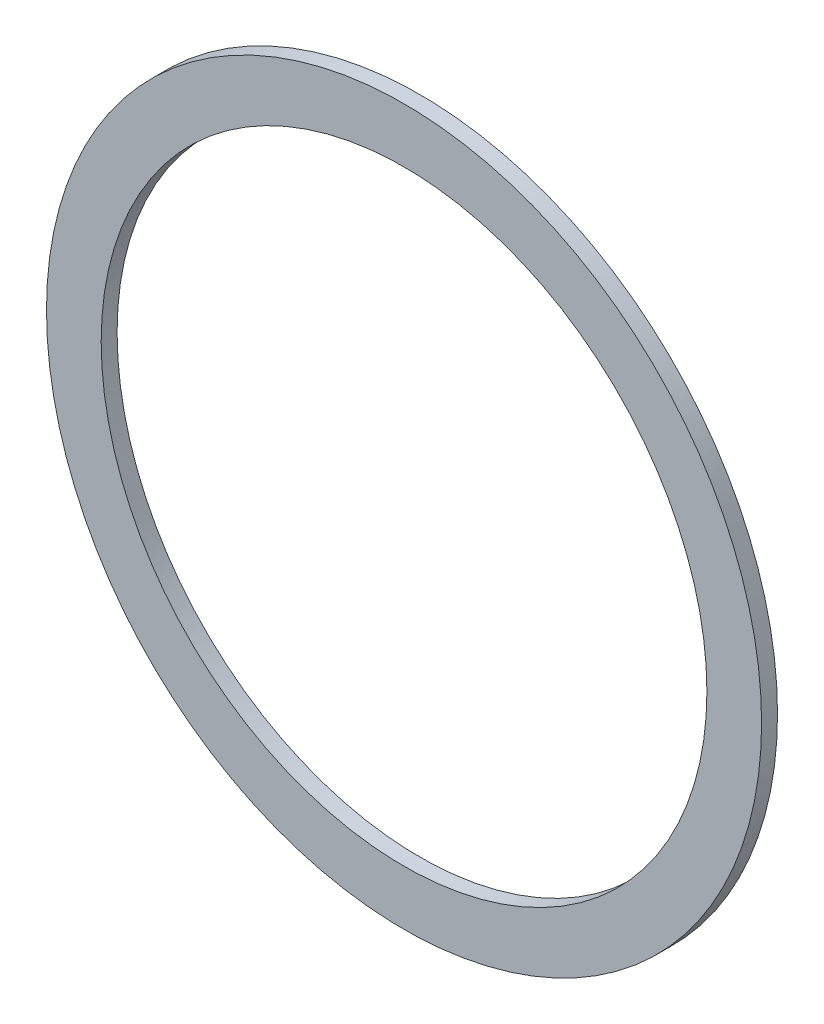
ISO-10303-21;
HEADER;
FILE_DESCRIPTION(('STEP AP214'),'2;1');
FILE_NAME('part.step','',(''),(''),'','','');
FILE_SCHEMA(('AUTOMOTIVE_DESIGN { 1 0 10303 214 1 1 1 1 }'));
ENDSEC;
DATA;
#1=APPLICATION_CONTEXT('core data for automotive mechanical design processes');
#2=APPLICATION_PROTOCOL_DEFINITION('international standard','automotive_design',2000,#1);
#3=PRODUCT_CONTEXT('',#1,'mechanical');
#4=PRODUCT('Part','Part','',(#3));
#5=PRODUCT_RELATED_PRODUCT_CATEGORY('part','',(#4));
#6=PRODUCT_DEFINITION_FORMATION('','',#4);
#7=PRODUCT_DEFINITION_CONTEXT('part definition',#1,'design');
#8=PRODUCT_DEFINITION('design','',#6,#7);
#9=PRODUCT_DEFINITION_SHAPE('','',#8);
#10=(LENGTH_UNIT() NAMED_UNIT(*) SI_UNIT(.MILLI.,.METRE.));
#11=(NAMED_UNIT(*) PLANE_ANGLE_UNIT() SI_UNIT($,.RADIAN.));
#12=(NAMED_UNIT(*) SI_UNIT($,.STERADIAN.) SOLID_ANGLE_UNIT());
#13=UNCERTAINTY_MEASURE_WITH_UNIT(LENGTH_MEASURE(1.E-05),#10,'distance_accuracy_value','');
#14=(GEOMETRIC_REPRESENTATION_CONTEXT(3) GLOBAL_UNCERTAINTY_ASSIGNED_CONTEXT((#13)) GLOBAL_UNIT_ASSIGNED_CONTEXT((#10,
#11,#12)) REPRESENTATION_CONTEXT('',''));
#15=CARTESIAN_POINT('',(0.,0.,0.));
#16=DIRECTION('',(0.,0.,1.));
#17=DIRECTION('',(1.,0.,0.));
#18=AXIS2_PLACEMENT_3D('',#15,#16,#17);
#19=CARTESIAN_POINT('',(-0.233133075329691,-0.0848366381590519,0.));
#20=DIRECTION('',(0.,0.,1.));
#21=DIRECTION('',(-1.,0.,0.));
#22=AXIS2_PLACEMENT_3D('',#19,#20,#21);
#23=CYLINDRICAL_SURFACE('',#22,0.0190283605039257);
#24=CARTESIAN_POINT('',(-0.214104714825765,-0.0848366381590519,-0.000499999999999999));
#25=CARTESIAN_POINT('',(-0.214104714825765,-0.0848366381590519,0.000499999999999999));
#26=B_SPLINE_CURVE_WITH_KNOTS('',1,(#24,#25),.UNSPECIFIED.,.F.,.F.,(2,2),(-0.000499999999999999,
0.000499999999999999),.UNSPECIFIED.);
#27=CARTESIAN_POINT('',(-0.214104714825765,-0.0848366381590519,-0.000499999999999999));
#28=VERTEX_POINT('',#27);
#29=CARTESIAN_POINT('',(-0.214104714825765,-0.0848366381590519,0.000499999999999999));
#30=VERTEX_POINT('',#29);
#31=EDGE_CURVE('E11',#28,#30,#26,.T.);
#32=ORIENTED_EDGE('',*,*,#31,.T.);
#33=CARTESIAN_POINT('',(-0.233133075329691,-0.0848366381590519,0.000499999999999999));
#34=DIRECTION('',(0.,0.,-1.));
#35=DIRECTION('',(-1.,0.,0.));
#36=AXIS2_PLACEMENT_3D('',#33,#34,#35);
#37=CIRCLE('',#36,0.0190283605039257);
#38=EDGE_CURVE('E26',#30,#30,#37,.T.);
#39=ORIENTED_EDGE('',*,*,#38,.F.);
#40=ORIENTED_EDGE('',*,*,#31,.F.);
#41=CARTESIAN_POINT('',(-0.233133075329691,-0.0848366381590519,-0.000499999999999999));
#42=DIRECTION('',(0.,0.,1.));
#43=DIRECTION('',(-1.,0.,0.));
#44=AXIS2_PLACEMENT_3D('',#41,#42,#43);
#45=CIRCLE('',#44,0.0190283605039257);
#46=EDGE_CURVE('E36',#28,#28,#45,.T.);
#47=ORIENTED_EDGE('',*,*,#46,.F.);
#48=EDGE_LOOP('',(#32,#39,#40,#47));
#49=FACE_BOUND('',#48,.T.);
#50=ADVANCED_FACE('F17',(#49),#23,.F.);
#51=CARTESIAN_POINT('',(-0.233133075329691,-0.0848366381590519,-0.000499999999999999));
#52=DIRECTION('',(0.,0.,1.));
#53=DIRECTION('',(1.,0.,0.));
#54=AXIS2_PLACEMENT_3D('',#51,#52,#53);
#55=PLANE('',#54);
#56=CARTESIAN_POINT('',(-0.233133075329691,-0.0848366381590519,-0.000499999999999999));
#57=DIRECTION('',(0.,0.,-1.));
#58=DIRECTION('',(-1.,0.,0.));
#59=AXIS2_PLACEMENT_3D('',#56,#57,#58);
#60=CIRCLE('',#59,0.0224642789042613);
#61=CARTESIAN_POINT('',(-0.210668796425429,-0.0848366381590519,-0.000499999999999999));
#62=VERTEX_POINT('',#61);
#63=EDGE_CURVE('E50',#62,#62,#60,.T.);
#64=ORIENTED_EDGE('',*,*,#63,.T.);
#65=EDGE_LOOP('',(#64));
#66=FACE_BOUND('',#65,.T.);
#67=ORIENTED_EDGE('',*,*,#46,.T.);
#68=EDGE_LOOP('',(#67));
#69=FACE_BOUND('',#68,.T.);
#70=ADVANCED_FACE('F64',(#66,#69),#55,.F.);
#71=CARTESIAN_POINT('',(-0.233133075329691,-0.0848366381590519,0.));
#72=DIRECTION('',(0.,0.,1.));
#73=DIRECTION('',(-1.,0.,0.));
#74=AXIS2_PLACEMENT_3D('',#71,#72,#73);
#75=CYLINDRICAL_SURFACE('',#74,0.0224642789042613);
#76=ORIENTED_EDGE('',*,*,#63,.F.);
#77=CARTESIAN_POINT('',(-0.210668796425429,-0.0848366381590519,-0.000499999999999999));
#78=CARTESIAN_POINT('',(-0.210668796425429,-0.0848366381590519,0.000499999999999999));
#79=B_SPLINE_CURVE_WITH_KNOTS('',1,(#77,#78),.UNSPECIFIED.,.F.,.F.,(2,2),(-0.000499999999999999,
0.000499999999999999),.UNSPECIFIED.);
#80=CARTESIAN_POINT('',(-0.210668796425429,-0.0848366381590519,0.000499999999999999));
#81=VERTEX_POINT('',#80);
#82=EDGE_CURVE('E46',#62,#81,#79,.T.);
#83=ORIENTED_EDGE('',*,*,#82,.T.);
#84=CARTESIAN_POINT('',(-0.233133075329691,-0.0848366381590519,0.000499999999999999));
#85=DIRECTION('',(0.,0.,1.));
#86=DIRECTION('',(-1.,0.,0.));
#87=AXIS2_PLACEMENT_3D('',#84,#85,#86);
#88=CIRCLE('',#87,0.0224642789042613);
#89=EDGE_CURVE('E49',#81,#81,#88,.T.);
#90=ORIENTED_EDGE('',*,*,#89,.F.);
#91=ORIENTED_EDGE('',*,*,#82,.F.);
#92=EDGE_LOOP('',(#76,#83,#90,#91));
#93=FACE_BOUND('',#92,.T.);
#94=ADVANCED_FACE('F48',(#93),#75,.T.);
#95=CARTESIAN_POINT('',(-0.233133075329691,-0.0848366381590519,0.000499999999999999));
#96=DIRECTION('',(0.,0.,1.));
#97=DIRECTION('',(1.,0.,0.));
#98=AXIS2_PLACEMENT_3D('',#95,#96,#97);
#99=PLANE('',#98);
#100=ORIENTED_EDGE('',*,*,#89,.T.);
#101=EDGE_LOOP('',(#100));
#102=FACE_BOUND('',#101,.T.);
#103=ORIENTED_EDGE('',*,*,#38,.T.);
#104=EDGE_LOOP('',(#103));
#105=FACE_BOUND('',#104,.T.);
#106=ADVANCED_FACE('F53',(#102,#105),#99,.T.);
#107=CLOSED_SHELL('',(#50,#70,#94,#106));
#108=MANIFOLD_SOLID_BREP('B1',#107);
#109=ADVANCED_BREP_SHAPE_REPRESENTATION('',(#18,#108),#14);
#110=SHAPE_DEFINITION_REPRESENTATION(#9,#109);
ENDSEC;
END-ISO-10303-21;
